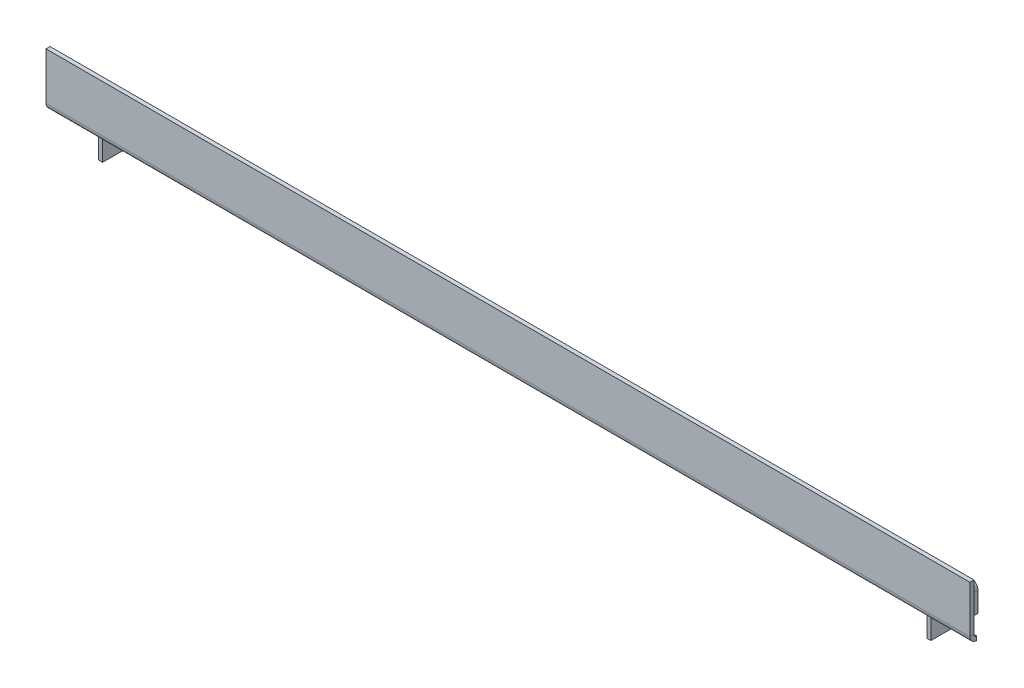
ISO-10303-21;
HEADER;
FILE_DESCRIPTION(('STEP AP214'),'2;1');
FILE_NAME('part.step','',(''),(''),'','','');
FILE_SCHEMA(('AUTOMOTIVE_DESIGN { 1 0 10303 214 1 1 1 1 }'));
ENDSEC;
DATA;
#1=APPLICATION_CONTEXT('core data for automotive mechanical design processes');
#2=APPLICATION_PROTOCOL_DEFINITION('international standard','automotive_design',2000,#1);
#3=PRODUCT_CONTEXT('',#1,'mechanical');
#4=PRODUCT('Part','Part','',(#3));
#5=PRODUCT_RELATED_PRODUCT_CATEGORY('part','',(#4));
#6=PRODUCT_DEFINITION_FORMATION('','',#4);
#7=PRODUCT_DEFINITION_CONTEXT('part definition',#1,'design');
#8=PRODUCT_DEFINITION('design','',#6,#7);
#9=PRODUCT_DEFINITION_SHAPE('','',#8);
#10=(LENGTH_UNIT() NAMED_UNIT(*) SI_UNIT(.MILLI.,.METRE.));
#11=(NAMED_UNIT(*) PLANE_ANGLE_UNIT() SI_UNIT($,.RADIAN.));
#12=(NAMED_UNIT(*) SI_UNIT($,.STERADIAN.) SOLID_ANGLE_UNIT());
#13=UNCERTAINTY_MEASURE_WITH_UNIT(LENGTH_MEASURE(1.E-05),#10,'distance_accuracy_value','');
#14=(GEOMETRIC_REPRESENTATION_CONTEXT(3) GLOBAL_UNCERTAINTY_ASSIGNED_CONTEXT((#13)) GLOBAL_UNIT_ASSIGNED_CONTEXT((#10,
#11,#12)) REPRESENTATION_CONTEXT('',''));
#15=CARTESIAN_POINT('',(0.,0.,0.));
#16=DIRECTION('',(0.,0.,1.));
#17=DIRECTION('',(1.,0.,0.));
#18=AXIS2_PLACEMENT_3D('',#15,#16,#17);
#19=CARTESIAN_POINT('',(343.,0.499999999999997,-0.999999999999997));
#20=DIRECTION('',(0.,0.,-1.));
#21=DIRECTION('',(0.,1.,0.));
#22=AXIS2_PLACEMENT_3D('',#19,#20,#21);
#23=PLANE('',#22);
#24=DIRECTION('',(1.,0.,0.));
#25=VECTOR('',#24,1.);
#26=CARTESIAN_POINT('',(343.,0.499999999999997,-0.999999999999997));
#27=LINE('',#26,#25);
#28=CARTESIAN_POINT('',(343.,0.499999999999997,-0.999999999999997));
#29=VERTEX_POINT('',#28);
#30=CARTESIAN_POINT('',(325.791287847478,0.499999999999997,-0.999999999999997));
#31=VERTEX_POINT('',#30);
#32=EDGE_CURVE('E366',#29,#31,#27,.F.);
#33=ORIENTED_EDGE('',*,*,#32,.T.);
#34=CARTESIAN_POINT('',(323.5,-0.500000000000007,-0.999999999999997));
#35=DIRECTION('',(0.,0.,1.));
#36=DIRECTION('',(1.,0.,0.));
#37=AXIS2_PLACEMENT_3D('',#34,#35,#36);
#38=CIRCLE('',#37,2.5);
#39=CARTESIAN_POINT('',(323.5,2.,-0.999999999999997));
#40=VERTEX_POINT('',#39);
#41=EDGE_CURVE('E13',#31,#40,#38,.T.);
#42=ORIENTED_EDGE('',*,*,#41,.T.);
#43=DIRECTION('',(1.,0.,0.));
#44=VECTOR('',#43,1.);
#45=CARTESIAN_POINT('',(343.,2.,-0.999999999999997));
#46=LINE('',#45,#44);
#47=CARTESIAN_POINT('',(343.,2.,-0.999999999999997));
#48=VERTEX_POINT('',#47);
#49=EDGE_CURVE('E379',#48,#40,#46,.F.);
#50=ORIENTED_EDGE('',*,*,#49,.F.);
#51=DIRECTION('',(0.,-1.,0.));
#52=VECTOR('',#51,1.);
#53=CARTESIAN_POINT('',(343.,2.,-0.999999999999997));
#54=LINE('',#53,#52);
#55=EDGE_CURVE('E372',#48,#29,#54,.T.);
#56=ORIENTED_EDGE('',*,*,#55,.T.);
#57=EDGE_LOOP('',(#33,#42,#50,#56));
#58=FACE_BOUND('',#57,.T.);
#59=ADVANCED_FACE('F78',(#58),#23,.T.);
#60=CARTESIAN_POINT('',(0.,2.,0.));
#61=DIRECTION('',(0.,-1.,0.));
#62=DIRECTION('',(0.,0.,-1.));
#63=AXIS2_PLACEMENT_3D('',#60,#61,#62);
#64=PLANE('',#63);
#65=DIRECTION('',(0.,0.,1.));
#66=VECTOR('',#65,1.);
#67=CARTESIAN_POINT('',(323.5,1.99999999999999,-0.999999999999997));
#68=LINE('',#67,#66);
#69=CARTESIAN_POINT('',(323.5,2.,-18.5));
#70=VERTEX_POINT('',#69);
#71=EDGE_CURVE('E218',#40,#70,#68,.F.);
#72=ORIENTED_EDGE('',*,*,#71,.T.);
#73=DIRECTION('',(-1.,0.,0.));
#74=VECTOR('',#73,1.);
#75=CARTESIAN_POINT('',(0.,2.,-18.5));
#76=LINE('',#75,#74);
#77=CARTESIAN_POINT('',(19.5,2.,-18.5));
#78=VERTEX_POINT('',#77);
#79=EDGE_CURVE('E87',#70,#78,#76,.T.);
#80=ORIENTED_EDGE('',*,*,#79,.T.);
#81=DIRECTION('',(0.,0.,-1.));
#82=VECTOR('',#81,1.);
#83=CARTESIAN_POINT('',(19.5,2.,-18.5));
#84=LINE('',#83,#82);
#85=CARTESIAN_POINT('',(19.5,2.,-1.));
#86=VERTEX_POINT('',#85);
#87=EDGE_CURVE('E308',#78,#86,#84,.F.);
#88=ORIENTED_EDGE('',*,*,#87,.T.);
#89=EDGE_CURVE('E382',#40,#86,#46,.F.);
#90=ORIENTED_EDGE('',*,*,#89,.F.);
#91=EDGE_LOOP('',(#72,#80,#88,#90));
#92=FACE_BOUND('',#91,.T.);
#93=ADVANCED_FACE('F430',(#92),#64,.F.);
#94=CARTESIAN_POINT('',(0.,0.5,0.));
#95=DIRECTION('',(0.,-1.,0.));
#96=DIRECTION('',(0.,0.,-1.));
#97=AXIS2_PLACEMENT_3D('',#94,#95,#96);
#98=PLANE('',#97);
#99=DIRECTION('',(1.,0.,0.));
#100=VECTOR('',#99,1.);
#101=CARTESIAN_POINT('',(0.,0.5,-18.5));
#102=LINE('',#101,#100);
#103=CARTESIAN_POINT('',(323.5,0.499999999999994,-18.5));
#104=VERTEX_POINT('',#103);
#105=CARTESIAN_POINT('',(19.5,0.500000000000001,-18.5));
#106=VERTEX_POINT('',#105);
#107=EDGE_CURVE('E82',#104,#106,#102,.F.);
#108=ORIENTED_EDGE('',*,*,#107,.F.);
#109=DIRECTION('',(0.,0.,1.));
#110=VECTOR('',#109,1.);
#111=CARTESIAN_POINT('',(323.5,0.499999999999994,-0.999999999999997));
#112=LINE('',#111,#110);
#113=CARTESIAN_POINT('',(323.5,0.499999999999994,-0.999999999999997));
#114=VERTEX_POINT('',#113);
#115=EDGE_CURVE('E269',#114,#104,#112,.F.);
#116=ORIENTED_EDGE('',*,*,#115,.F.);
#117=CARTESIAN_POINT('',(19.5,0.500000000000001,-1.));
#118=VERTEX_POINT('',#117);
#119=EDGE_CURVE('E369',#114,#118,#27,.F.);
#120=ORIENTED_EDGE('',*,*,#119,.T.);
#121=DIRECTION('',(0.,0.,-1.));
#122=VECTOR('',#121,1.);
#123=CARTESIAN_POINT('',(19.5,0.500000000000001,-18.5));
#124=LINE('',#123,#122);
#125=EDGE_CURVE('E322',#106,#118,#124,.F.);
#126=ORIENTED_EDGE('',*,*,#125,.F.);
#127=EDGE_LOOP('',(#108,#116,#120,#126));
#128=FACE_BOUND('',#127,.T.);
#129=ADVANCED_FACE('F398',(#128),#98,.T.);
#130=CARTESIAN_POINT('',(19.5,0.500000000000001,-1.));
#131=DIRECTION('',(0.,0.,-1.));
#132=DIRECTION('',(-1.,0.,0.));
#133=AXIS2_PLACEMENT_3D('',#130,#131,#132);
#134=PLANE('',#133);
#135=CARTESIAN_POINT('',(0.,2.,-0.999999999999997));
#136=VERTEX_POINT('',#135);
#137=EDGE_CURVE('E383',#86,#136,#46,.F.);
#138=ORIENTED_EDGE('',*,*,#137,.F.);
#139=CARTESIAN_POINT('',(19.5,-0.5,-1.));
#140=DIRECTION('',(0.,0.,-1.));
#141=DIRECTION('',(-1.,0.,0.));
#142=AXIS2_PLACEMENT_3D('',#139,#140,#141);
#143=CIRCLE('',#142,2.5);
#144=CARTESIAN_POINT('',(17.2087121525221,0.500000000000001,-1.));
#145=VERTEX_POINT('',#144);
#146=EDGE_CURVE('E313',#86,#145,#143,.F.);
#147=ORIENTED_EDGE('',*,*,#146,.T.);
#148=DIRECTION('',(-1.,0.,0.));
#149=VECTOR('',#148,1.);
#150=CARTESIAN_POINT('',(19.5,0.500000000000001,-1.));
#151=LINE('',#150,#149);
#152=CARTESIAN_POINT('',(0.,0.5,-0.999999999999997));
#153=VERTEX_POINT('',#152);
#154=EDGE_CURVE('E329',#145,#153,#151,.T.);
#155=ORIENTED_EDGE('',*,*,#154,.T.);
#156=DIRECTION('',(0.,-1.,0.));
#157=VECTOR('',#156,1.);
#158=CARTESIAN_POINT('',(0.,2.,-0.999999999999997));
#159=LINE('',#158,#157);
#160=EDGE_CURVE('E386',#136,#153,#159,.T.);
#161=ORIENTED_EDGE('',*,*,#160,.F.);
#162=EDGE_LOOP('',(#138,#147,#155,#161));
#163=FACE_BOUND('',#162,.T.);
#164=ADVANCED_FACE('F488',(#163),#134,.T.);
#165=CARTESIAN_POINT('',(0.,2.,-18.5));
#166=DIRECTION('',(0.,0.,1.));
#167=DIRECTION('',(-1.,0.,0.));
#168=AXIS2_PLACEMENT_3D('',#165,#166,#167);
#169=PLANE('',#168);
#170=DIRECTION('',(0.,1.,0.));
#171=VECTOR('',#170,1.);
#172=CARTESIAN_POINT('',(323.5,0.499999999999994,-18.5));
#173=LINE('',#172,#171);
#174=EDGE_CURVE('E265',#104,#70,#173,.T.);
#175=ORIENTED_EDGE('',*,*,#174,.F.);
#176=ORIENTED_EDGE('',*,*,#107,.T.);
#177=DIRECTION('',(0.,1.,0.));
#178=VECTOR('',#177,1.);
#179=CARTESIAN_POINT('',(19.5,0.500000000000001,-18.5));
#180=LINE('',#179,#178);
#181=EDGE_CURVE('E316',#106,#78,#180,.T.);
#182=ORIENTED_EDGE('',*,*,#181,.T.);
#183=ORIENTED_EDGE('',*,*,#79,.F.);
#184=EDGE_LOOP('',(#175,#176,#182,#183));
#185=FACE_BOUND('',#184,.T.);
#186=ADVANCED_FACE('F80',(#185),#169,.F.);
#187=CARTESIAN_POINT('',(0.,3.,-0.999999999999997));
#188=DIRECTION('',(-1.,0.,0.));
#189=DIRECTION('',(0.,0.,1.));
#190=AXIS2_PLACEMENT_3D('',#187,#188,#189);
#191=PLANE('',#190);
#192=DIRECTION('',(0.,0.,1.));
#193=VECTOR('',#192,1.);
#194=CARTESIAN_POINT('',(0.,3.,0.));
#195=LINE('',#194,#193);
#196=CARTESIAN_POINT('',(0.,2.99999999999999,0.));
#197=VERTEX_POINT('',#196);
#198=CARTESIAN_POINT('',(0.,2.99999999999999,1.5));
#199=VERTEX_POINT('',#198);
#200=EDGE_CURVE('E333',#197,#199,#195,.T.);
#201=ORIENTED_EDGE('',*,*,#200,.F.);
#202=CARTESIAN_POINT('',(0.,3.,-0.999999999999997));
#203=DIRECTION('',(1.,0.,0.));
#204=DIRECTION('',(0.,0.,-1.));
#205=AXIS2_PLACEMENT_3D('',#202,#203,#204);
#206=CIRCLE('',#205,1.);
#207=EDGE_CURVE('E376',#136,#197,#206,.F.);
#208=ORIENTED_EDGE('',*,*,#207,.F.);
#209=ORIENTED_EDGE('',*,*,#160,.T.);
#210=CARTESIAN_POINT('',(0.,3.,-0.999999999999997));
#211=DIRECTION('',(1.,0.,0.));
#212=DIRECTION('',(0.,0.,-1.));
#213=AXIS2_PLACEMENT_3D('',#210,#211,#212);
#214=CIRCLE('',#213,2.5);
#215=EDGE_CURVE('E368',#153,#199,#214,.F.);
#216=ORIENTED_EDGE('',*,*,#215,.T.);
#217=EDGE_LOOP('',(#201,#208,#209,#216));
#218=FACE_BOUND('',#217,.T.);
#219=ADVANCED_FACE('F517',(#218),#191,.T.);
#220=CARTESIAN_POINT('',(343.,3.,-0.999999999999997));
#221=DIRECTION('',(-1.,0.,0.));
#222=DIRECTION('',(0.,0.,1.));
#223=AXIS2_PLACEMENT_3D('',#220,#221,#222);
#224=PLANE('',#223);
#225=CARTESIAN_POINT('',(343.,3.,-0.999999999999997));
#226=DIRECTION('',(1.,0.,0.));
#227=DIRECTION('',(0.,0.,-1.));
#228=AXIS2_PLACEMENT_3D('',#225,#226,#227);
#229=CIRCLE('',#228,1.);
#230=CARTESIAN_POINT('',(343.,2.99999999999999,0.));
#231=VERTEX_POINT('',#230);
#232=EDGE_CURVE('E363',#231,#48,#229,.T.);
#233=ORIENTED_EDGE('',*,*,#232,.F.);
#234=DIRECTION('',(0.,0.,1.));
#235=VECTOR('',#234,1.);
#236=CARTESIAN_POINT('',(343.,3.,0.));
#237=LINE('',#236,#235);
#238=CARTESIAN_POINT('',(343.,3.,1.5));
#239=VERTEX_POINT('',#238);
#240=EDGE_CURVE('E336',#231,#239,#237,.T.);
#241=ORIENTED_EDGE('',*,*,#240,.T.);
#242=CARTESIAN_POINT('',(343.,3.,-0.999999999999997));
#243=DIRECTION('',(1.,0.,0.));
#244=DIRECTION('',(0.,0.,-1.));
#245=AXIS2_PLACEMENT_3D('',#242,#243,#244);
#246=CIRCLE('',#245,2.5);
#247=EDGE_CURVE('E373',#239,#29,#246,.T.);
#248=ORIENTED_EDGE('',*,*,#247,.T.);
#249=ORIENTED_EDGE('',*,*,#55,.F.);
#250=EDGE_LOOP('',(#233,#241,#248,#249));
#251=FACE_BOUND('',#250,.T.);
#252=ADVANCED_FACE('F514',(#251),#224,.F.);
#253=CARTESIAN_POINT('',(343.,3.,-0.999999999999997));
#254=DIRECTION('',(1.,0.,0.));
#255=DIRECTION('',(0.,0.,1.));
#256=AXIS2_PLACEMENT_3D('',#253,#254,#255);
#257=CYLINDRICAL_SURFACE('',#256,2.5);
#258=ORIENTED_EDGE('',*,*,#32,.F.);
#259=ORIENTED_EDGE('',*,*,#247,.F.);
#260=DIRECTION('',(1.,0.,0.));
#261=VECTOR('',#260,1.);
#262=CARTESIAN_POINT('',(0.,3.,1.5));
#263=LINE('',#262,#261);
#264=EDGE_CURVE('E339',#199,#239,#263,.T.);
#265=ORIENTED_EDGE('',*,*,#264,.F.);
#266=ORIENTED_EDGE('',*,*,#215,.F.);
#267=ORIENTED_EDGE('',*,*,#154,.F.);
#268=EDGE_CURVE('E330',#118,#145,#151,.T.);
#269=ORIENTED_EDGE('',*,*,#268,.F.);
#270=ORIENTED_EDGE('',*,*,#119,.F.);
#271=EDGE_CURVE('E96',#31,#114,#27,.F.);
#272=ORIENTED_EDGE('',*,*,#271,.F.);
#273=EDGE_LOOP('',(#258,#259,#265,#266,#267,#269,#270,#272));
#274=FACE_BOUND('',#273,.T.);
#275=ADVANCED_FACE('F511',(#274),#257,.T.);
#276=CARTESIAN_POINT('',(343.,3.,-0.999999999999997));
#277=DIRECTION('',(1.,0.,0.));
#278=DIRECTION('',(0.,0.,1.));
#279=AXIS2_PLACEMENT_3D('',#276,#277,#278);
#280=CYLINDRICAL_SURFACE('',#279,1.);
#281=ORIENTED_EDGE('',*,*,#49,.T.);
#282=ORIENTED_EDGE('',*,*,#89,.T.);
#283=ORIENTED_EDGE('',*,*,#137,.T.);
#284=ORIENTED_EDGE('',*,*,#207,.T.);
#285=DIRECTION('',(1.,0.,0.));
#286=VECTOR('',#285,1.);
#287=CARTESIAN_POINT('',(0.,3.,0.));
#288=LINE('',#287,#286);
#289=EDGE_CURVE('E334',#197,#231,#288,.T.);
#290=ORIENTED_EDGE('',*,*,#289,.T.);
#291=ORIENTED_EDGE('',*,*,#232,.T.);
#292=EDGE_LOOP('',(#281,#282,#283,#284,#290,#291));
#293=FACE_BOUND('',#292,.T.);
#294=ADVANCED_FACE('F434',(#293),#280,.F.);
#295=CARTESIAN_POINT('',(343.,1.99999999999999,1.5));
#296=DIRECTION('',(1.,0.,0.));
#297=DIRECTION('',(0.,0.,-1.));
#298=AXIS2_PLACEMENT_3D('',#295,#296,#297);
#299=PLANE('',#298);
#300=DIRECTION('',(0.,-1.,0.));
#301=VECTOR('',#300,1.);
#302=CARTESIAN_POINT('',(343.,1.99999999999999,1.5));
#303=LINE('',#302,#301);
#304=CARTESIAN_POINT('',(343.,20.5,1.50000000000006));
#305=VERTEX_POINT('',#304);
#306=EDGE_CURVE('E351',#305,#239,#303,.T.);
#307=ORIENTED_EDGE('',*,*,#306,.T.);
#308=ORIENTED_EDGE('',*,*,#240,.F.);
#309=DIRECTION('',(0.,-1.,0.));
#310=VECTOR('',#309,1.);
#311=CARTESIAN_POINT('',(343.,2.,0.));
#312=LINE('',#311,#310);
#313=CARTESIAN_POINT('',(343.,20.5,0.));
#314=VERTEX_POINT('',#313);
#315=EDGE_CURVE('E348',#314,#231,#312,.T.);
#316=ORIENTED_EDGE('',*,*,#315,.F.);
#317=DIRECTION('',(0.,0.,-1.));
#318=VECTOR('',#317,1.);
#319=CARTESIAN_POINT('',(343.,20.5,1.50000000000006));
#320=LINE('',#319,#318);
#321=EDGE_CURVE('E361',#305,#314,#320,.T.);
#322=ORIENTED_EDGE('',*,*,#321,.F.);
#323=EDGE_LOOP('',(#307,#308,#316,#322));
#324=FACE_BOUND('',#323,.T.);
#325=ADVANCED_FACE('F501',(#324),#299,.T.);
#326=CARTESIAN_POINT('',(0.,20.5,1.50000000000006));
#327=DIRECTION('',(-1.,0.,0.));
#328=DIRECTION('',(0.,0.,1.));
#329=AXIS2_PLACEMENT_3D('',#326,#327,#328);
#330=PLANE('',#329);
#331=DIRECTION('',(0.,1.,0.));
#332=VECTOR('',#331,1.);
#333=CARTESIAN_POINT('',(0.,20.5,0.));
#334=LINE('',#333,#332);
#335=CARTESIAN_POINT('',(0.,20.5,0.));
#336=VERTEX_POINT('',#335);
#337=EDGE_CURVE('E344',#197,#336,#334,.T.);
#338=ORIENTED_EDGE('',*,*,#337,.F.);
#339=ORIENTED_EDGE('',*,*,#200,.T.);
#340=DIRECTION('',(0.,1.,0.));
#341=VECTOR('',#340,1.);
#342=CARTESIAN_POINT('',(0.,20.5,1.50000000000006));
#343=LINE('',#342,#341);
#344=CARTESIAN_POINT('',(0.,20.5,1.50000000000006));
#345=VERTEX_POINT('',#344);
#346=EDGE_CURVE('E345',#199,#345,#343,.T.);
#347=ORIENTED_EDGE('',*,*,#346,.T.);
#348=DIRECTION('',(0.,0.,-1.));
#349=VECTOR('',#348,1.);
#350=CARTESIAN_POINT('',(0.,20.5,1.50000000000006));
#351=LINE('',#350,#349);
#352=EDGE_CURVE('E354',#345,#336,#351,.T.);
#353=ORIENTED_EDGE('',*,*,#352,.T.);
#354=EDGE_LOOP('',(#338,#339,#347,#353));
#355=FACE_BOUND('',#354,.T.);
#356=ADVANCED_FACE('F496',(#355),#330,.T.);
#357=CARTESIAN_POINT('',(0.,0.,1.49999999999999));
#358=DIRECTION('',(0.,0.,1.));
#359=DIRECTION('',(0.,-1.,0.));
#360=AXIS2_PLACEMENT_3D('',#357,#358,#359);
#361=PLANE('',#360);
#362=ORIENTED_EDGE('',*,*,#346,.F.);
#363=ORIENTED_EDGE('',*,*,#264,.T.);
#364=ORIENTED_EDGE('',*,*,#306,.F.);
#365=DIRECTION('',(1.,0.,0.));
#366=VECTOR('',#365,1.);
#367=CARTESIAN_POINT('',(343.,20.5,1.50000000000006));
#368=LINE('',#367,#366);
#369=EDGE_CURVE('E347',#345,#305,#368,.T.);
#370=ORIENTED_EDGE('',*,*,#369,.F.);
#371=EDGE_LOOP('',(#362,#363,#364,#370));
#372=FACE_BOUND('',#371,.T.);
#373=ADVANCED_FACE('F492',(#372),#361,.T.);
#374=CARTESIAN_POINT('',(0.,0.,0.));
#375=DIRECTION('',(0.,0.,1.));
#376=DIRECTION('',(0.,-1.,0.));
#377=AXIS2_PLACEMENT_3D('',#374,#375,#376);
#378=PLANE('',#377);
#379=ORIENTED_EDGE('',*,*,#289,.F.);
#380=ORIENTED_EDGE('',*,*,#337,.T.);
#381=DIRECTION('',(1.,0.,0.));
#382=VECTOR('',#381,1.);
#383=CARTESIAN_POINT('',(343.,20.5,0.));
#384=LINE('',#383,#382);
#385=EDGE_CURVE('E356',#336,#314,#384,.T.);
#386=ORIENTED_EDGE('',*,*,#385,.T.);
#387=ORIENTED_EDGE('',*,*,#315,.T.);
#388=EDGE_LOOP('',(#379,#380,#386,#387));
#389=FACE_BOUND('',#388,.T.);
#390=ADVANCED_FACE('F495',(#389),#378,.F.);
#391=CARTESIAN_POINT('',(343.,20.5,1.50000000000006));
#392=DIRECTION('',(0.,1.,0.));
#393=DIRECTION('',(0.,0.,1.));
#394=AXIS2_PLACEMENT_3D('',#391,#392,#393);
#395=PLANE('',#394);
#396=ORIENTED_EDGE('',*,*,#385,.F.);
#397=ORIENTED_EDGE('',*,*,#352,.F.);
#398=ORIENTED_EDGE('',*,*,#369,.T.);
#399=ORIENTED_EDGE('',*,*,#321,.T.);
#400=EDGE_LOOP('',(#396,#397,#398,#399));
#401=FACE_BOUND('',#400,.T.);
#402=ADVANCED_FACE('F484',(#401),#395,.T.);
#403=CARTESIAN_POINT('',(19.5,-0.5,-1.));
#404=DIRECTION('',(0.,0.,1.));
#405=DIRECTION('',(1.,0.,0.));
#406=AXIS2_PLACEMENT_3D('',#403,#404,#405);
#407=PLANE('',#406);
#408=CARTESIAN_POINT('',(19.5,-0.5,-1.));
#409=DIRECTION('',(0.,0.,-1.));
#410=DIRECTION('',(-1.,0.,0.));
#411=AXIS2_PLACEMENT_3D('',#408,#409,#410);
#412=CIRCLE('',#411,1.);
#413=CARTESIAN_POINT('',(18.5,-0.499999999999997,-1.));
#414=VERTEX_POINT('',#413);
#415=EDGE_CURVE('E319',#118,#414,#412,.F.);
#416=ORIENTED_EDGE('',*,*,#415,.F.);
#417=ORIENTED_EDGE('',*,*,#268,.T.);
#418=CARTESIAN_POINT('',(17.,-0.499999999999991,-1.));
#419=VERTEX_POINT('',#418);
#420=EDGE_CURVE('E311',#145,#419,#143,.F.);
#421=ORIENTED_EDGE('',*,*,#420,.T.);
#422=DIRECTION('',(-1.,0.,0.));
#423=VECTOR('',#422,1.);
#424=CARTESIAN_POINT('',(17.,-0.499999999999992,-0.999999999999997));
#425=LINE('',#424,#423);
#426=EDGE_CURVE('E275',#414,#419,#425,.T.);
#427=ORIENTED_EDGE('',*,*,#426,.F.);
#428=EDGE_LOOP('',(#416,#417,#421,#427));
#429=FACE_BOUND('',#428,.T.);
#430=ADVANCED_FACE('F481',(#429),#407,.T.);
#431=CARTESIAN_POINT('',(19.5,-0.5,-18.5));
#432=DIRECTION('',(0.,0.,1.));
#433=DIRECTION('',(1.,0.,0.));
#434=AXIS2_PLACEMENT_3D('',#431,#432,#433);
#435=PLANE('',#434);
#436=CARTESIAN_POINT('',(19.5,-0.5,-18.5));
#437=DIRECTION('',(0.,0.,-1.));
#438=DIRECTION('',(-1.,0.,0.));
#439=AXIS2_PLACEMENT_3D('',#436,#437,#438);
#440=CIRCLE('',#439,1.);
#441=CARTESIAN_POINT('',(18.5,-0.499999999999997,-18.5));
#442=VERTEX_POINT('',#441);
#443=EDGE_CURVE('E278',#442,#106,#440,.T.);
#444=ORIENTED_EDGE('',*,*,#443,.F.);
#445=DIRECTION('',(-1.,0.,0.));
#446=VECTOR('',#445,1.);
#447=CARTESIAN_POINT('',(18.5,-0.499999999999997,-18.5));
#448=LINE('',#447,#446);
#449=CARTESIAN_POINT('',(17.,-0.499999999999991,-18.5));
#450=VERTEX_POINT('',#449);
#451=EDGE_CURVE('E301',#442,#450,#448,.T.);
#452=ORIENTED_EDGE('',*,*,#451,.T.);
#453=CARTESIAN_POINT('',(19.5,-0.5,-18.5));
#454=DIRECTION('',(0.,0.,-1.));
#455=DIRECTION('',(-1.,0.,0.));
#456=AXIS2_PLACEMENT_3D('',#453,#454,#455);
#457=CIRCLE('',#456,2.5);
#458=EDGE_CURVE('E312',#450,#78,#457,.T.);
#459=ORIENTED_EDGE('',*,*,#458,.T.);
#460=ORIENTED_EDGE('',*,*,#181,.F.);
#461=EDGE_LOOP('',(#444,#452,#459,#460));
#462=FACE_BOUND('',#461,.T.);
#463=ADVANCED_FACE('F404',(#462),#435,.F.);
#464=CARTESIAN_POINT('',(19.5,-0.5,-18.5));
#465=DIRECTION('',(0.,0.,-1.));
#466=DIRECTION('',(-1.,0.,0.));
#467=AXIS2_PLACEMENT_3D('',#464,#465,#466);
#468=CYLINDRICAL_SURFACE('',#467,2.5);
#469=ORIENTED_EDGE('',*,*,#87,.F.);
#470=ORIENTED_EDGE('',*,*,#458,.F.);
#471=DIRECTION('',(0.,0.,-1.));
#472=VECTOR('',#471,1.);
#473=CARTESIAN_POINT('',(17.,-0.499999999999991,0.));
#474=LINE('',#473,#472);
#475=EDGE_CURVE('E298',#419,#450,#474,.T.);
#476=ORIENTED_EDGE('',*,*,#475,.F.);
#477=ORIENTED_EDGE('',*,*,#420,.F.);
#478=ORIENTED_EDGE('',*,*,#146,.F.);
#479=EDGE_LOOP('',(#469,#470,#476,#477,#478));
#480=FACE_BOUND('',#479,.T.);
#481=ADVANCED_FACE('F428',(#480),#468,.T.);
#482=CARTESIAN_POINT('',(19.5,-0.5,-18.5));
#483=DIRECTION('',(0.,0.,-1.));
#484=DIRECTION('',(-1.,0.,0.));
#485=AXIS2_PLACEMENT_3D('',#482,#483,#484);
#486=CYLINDRICAL_SURFACE('',#485,1.);
#487=ORIENTED_EDGE('',*,*,#125,.T.);
#488=ORIENTED_EDGE('',*,*,#415,.T.);
#489=DIRECTION('',(0.,0.,1.));
#490=VECTOR('',#489,1.);
#491=CARTESIAN_POINT('',(18.5,-0.499999999999997,-0.999999999999997));
#492=LINE('',#491,#490);
#493=EDGE_CURVE('E304',#414,#442,#492,.F.);
#494=ORIENTED_EDGE('',*,*,#493,.T.);
#495=ORIENTED_EDGE('',*,*,#443,.T.);
#496=EDGE_LOOP('',(#487,#488,#494,#495));
#497=FACE_BOUND('',#496,.T.);
#498=ADVANCED_FACE('F405',(#497),#486,.F.);
#499=CARTESIAN_POINT('',(17.,0.500000000000005,-18.5));
#500=DIRECTION('',(0.,0.,-1.));
#501=DIRECTION('',(-1.,0.,0.));
#502=AXIS2_PLACEMENT_3D('',#499,#500,#501);
#503=PLANE('',#502);
#504=DIRECTION('',(0.,1.,0.));
#505=VECTOR('',#504,1.);
#506=CARTESIAN_POINT('',(17.,0.500000000000005,-18.5));
#507=LINE('',#506,#505);
#508=CARTESIAN_POINT('',(17.,-8.,-18.5));
#509=VERTEX_POINT('',#508);
#510=EDGE_CURVE('E282',#509,#450,#507,.T.);
#511=ORIENTED_EDGE('',*,*,#510,.T.);
#512=ORIENTED_EDGE('',*,*,#451,.F.);
#513=DIRECTION('',(0.,-1.,0.));
#514=VECTOR('',#513,1.);
#515=CARTESIAN_POINT('',(18.5,0.,-18.5));
#516=LINE('',#515,#514);
#517=CARTESIAN_POINT('',(18.5,-8.00000000000001,-18.5));
#518=VERTEX_POINT('',#517);
#519=EDGE_CURVE('E290',#518,#442,#516,.F.);
#520=ORIENTED_EDGE('',*,*,#519,.F.);
#521=DIRECTION('',(1.,0.,0.));
#522=VECTOR('',#521,1.);
#523=CARTESIAN_POINT('',(17.,-8.,-18.5));
#524=LINE('',#523,#522);
#525=EDGE_CURVE('E276',#509,#518,#524,.T.);
#526=ORIENTED_EDGE('',*,*,#525,.F.);
#527=EDGE_LOOP('',(#511,#512,#520,#526));
#528=FACE_BOUND('',#527,.T.);
#529=ADVANCED_FACE('F421',(#528),#503,.T.);
#530=CARTESIAN_POINT('',(17.,-8.,-0.999999999999998));
#531=DIRECTION('',(0.,0.,1.));
#532=DIRECTION('',(0.,-1.,0.));
#533=AXIS2_PLACEMENT_3D('',#530,#531,#532);
#534=PLANE('',#533);
#535=DIRECTION('',(0.,1.,0.));
#536=VECTOR('',#535,1.);
#537=CARTESIAN_POINT('',(18.5,0.,-0.999999999999997));
#538=LINE('',#537,#536);
#539=CARTESIAN_POINT('',(18.5,-8.00000000000001,-0.999999999999998));
#540=VERTEX_POINT('',#539);
#541=EDGE_CURVE('E296',#414,#540,#538,.F.);
#542=ORIENTED_EDGE('',*,*,#541,.F.);
#543=ORIENTED_EDGE('',*,*,#426,.T.);
#544=DIRECTION('',(0.,-1.,0.));
#545=VECTOR('',#544,1.);
#546=CARTESIAN_POINT('',(17.,-8.,-0.999999999999998));
#547=LINE('',#546,#545);
#548=CARTESIAN_POINT('',(17.,-8.,-0.999999999999998));
#549=VERTEX_POINT('',#548);
#550=EDGE_CURVE('E288',#419,#549,#547,.T.);
#551=ORIENTED_EDGE('',*,*,#550,.T.);
#552=DIRECTION('',(1.,0.,0.));
#553=VECTOR('',#552,1.);
#554=CARTESIAN_POINT('',(17.,-8.,-0.999999999999998));
#555=LINE('',#554,#553);
#556=EDGE_CURVE('E279',#549,#540,#555,.T.);
#557=ORIENTED_EDGE('',*,*,#556,.T.);
#558=EDGE_LOOP('',(#542,#543,#551,#557));
#559=FACE_BOUND('',#558,.T.);
#560=ADVANCED_FACE('F413',(#559),#534,.T.);
#561=CARTESIAN_POINT('',(17.,0.,0.));
#562=DIRECTION('',(-1.,0.,0.));
#563=DIRECTION('',(0.,-1.,0.));
#564=AXIS2_PLACEMENT_3D('',#561,#562,#563);
#565=PLANE('',#564);
#566=ORIENTED_EDGE('',*,*,#550,.F.);
#567=ORIENTED_EDGE('',*,*,#475,.T.);
#568=ORIENTED_EDGE('',*,*,#510,.F.);
#569=DIRECTION('',(0.,0.,-1.));
#570=VECTOR('',#569,1.);
#571=CARTESIAN_POINT('',(17.,-8.,-18.5));
#572=LINE('',#571,#570);
#573=EDGE_CURVE('E285',#549,#509,#572,.T.);
#574=ORIENTED_EDGE('',*,*,#573,.F.);
#575=EDGE_LOOP('',(#566,#567,#568,#574));
#576=FACE_BOUND('',#575,.T.);
#577=ADVANCED_FACE('F425',(#576),#565,.T.);
#578=CARTESIAN_POINT('',(18.5,0.,0.));
#579=DIRECTION('',(-1.,0.,0.));
#580=DIRECTION('',(0.,-1.,0.));
#581=AXIS2_PLACEMENT_3D('',#578,#579,#580);
#582=PLANE('',#581);
#583=ORIENTED_EDGE('',*,*,#493,.F.);
#584=ORIENTED_EDGE('',*,*,#541,.T.);
#585=DIRECTION('',(0.,0.,1.));
#586=VECTOR('',#585,1.);
#587=CARTESIAN_POINT('',(18.5,-8.00000000000001,0.));
#588=LINE('',#587,#586);
#589=EDGE_CURVE('E293',#540,#518,#588,.F.);
#590=ORIENTED_EDGE('',*,*,#589,.T.);
#591=ORIENTED_EDGE('',*,*,#519,.T.);
#592=EDGE_LOOP('',(#583,#584,#590,#591));
#593=FACE_BOUND('',#592,.T.);
#594=ADVANCED_FACE('F409',(#593),#582,.F.);
#595=CARTESIAN_POINT('',(17.,-8.,-18.5));
#596=DIRECTION('',(0.,-1.,0.));
#597=DIRECTION('',(1.,0.,0.));
#598=AXIS2_PLACEMENT_3D('',#595,#596,#597);
#599=PLANE('',#598);
#600=ORIENTED_EDGE('',*,*,#589,.F.);
#601=ORIENTED_EDGE('',*,*,#556,.F.);
#602=ORIENTED_EDGE('',*,*,#573,.T.);
#603=ORIENTED_EDGE('',*,*,#525,.T.);
#604=EDGE_LOOP('',(#600,#601,#602,#603));
#605=FACE_BOUND('',#604,.T.);
#606=ADVANCED_FACE('F419',(#605),#599,.T.);
#607=CARTESIAN_POINT('',(323.5,-0.500000000000007,-18.5));
#608=DIRECTION('',(0.,0.,-1.));
#609=DIRECTION('',(-1.,0.,0.));
#610=AXIS2_PLACEMENT_3D('',#607,#608,#609);
#611=PLANE('',#610);
#612=DIRECTION('',(1.,0.,0.));
#613=VECTOR('',#612,1.);
#614=CARTESIAN_POINT('',(326.,-0.499999999999991,-18.5));
#615=LINE('',#614,#613);
#616=CARTESIAN_POINT('',(324.5,-0.5,-18.5));
#617=VERTEX_POINT('',#616);
#618=CARTESIAN_POINT('',(326.,-0.499999999999991,-18.5));
#619=VERTEX_POINT('',#618);
#620=EDGE_CURVE('E260',#617,#619,#615,.T.);
#621=ORIENTED_EDGE('',*,*,#620,.F.);
#622=CARTESIAN_POINT('',(323.5,-0.500000000000007,-18.5));
#623=DIRECTION('',(0.,0.,1.));
#624=DIRECTION('',(1.,0.,0.));
#625=AXIS2_PLACEMENT_3D('',#622,#623,#624);
#626=CIRCLE('',#625,1.);
#627=EDGE_CURVE('E219',#104,#617,#626,.F.);
#628=ORIENTED_EDGE('',*,*,#627,.F.);
#629=ORIENTED_EDGE('',*,*,#174,.T.);
#630=CARTESIAN_POINT('',(323.5,-0.500000000000007,-18.5));
#631=DIRECTION('',(0.,0.,1.));
#632=DIRECTION('',(1.,0.,0.));
#633=AXIS2_PLACEMENT_3D('',#630,#631,#632);
#634=CIRCLE('',#633,2.5);
#635=EDGE_CURVE('E264',#70,#619,#634,.F.);
#636=ORIENTED_EDGE('',*,*,#635,.T.);
#637=EDGE_LOOP('',(#621,#628,#629,#636));
#638=FACE_BOUND('',#637,.T.);
#639=ADVANCED_FACE('F438',(#638),#611,.T.);
#640=CARTESIAN_POINT('',(323.5,-0.500000000000007,-0.999999999999997));
#641=DIRECTION('',(0.,0.,-1.));
#642=DIRECTION('',(-1.,0.,0.));
#643=AXIS2_PLACEMENT_3D('',#640,#641,#642);
#644=PLANE('',#643);
#645=CARTESIAN_POINT('',(326.,-0.499999999999991,-0.999999999999997));
#646=VERTEX_POINT('',#645);
#647=EDGE_CURVE('E89',#646,#31,#38,.T.);
#648=ORIENTED_EDGE('',*,*,#647,.T.);
#649=ORIENTED_EDGE('',*,*,#271,.T.);
#650=CARTESIAN_POINT('',(323.5,-0.500000000000007,-0.999999999999997));
#651=DIRECTION('',(0.,0.,1.));
#652=DIRECTION('',(1.,0.,0.));
#653=AXIS2_PLACEMENT_3D('',#650,#651,#652);
#654=CIRCLE('',#653,1.);
#655=CARTESIAN_POINT('',(324.5,-0.5,-0.999999999999997));
#656=VERTEX_POINT('',#655);
#657=EDGE_CURVE('E225',#656,#114,#654,.T.);
#658=ORIENTED_EDGE('',*,*,#657,.F.);
#659=DIRECTION('',(1.,0.,0.));
#660=VECTOR('',#659,1.);
#661=CARTESIAN_POINT('',(324.5,-0.5,-0.999999999999997));
#662=LINE('',#661,#660);
#663=EDGE_CURVE('E222',#656,#646,#662,.T.);
#664=ORIENTED_EDGE('',*,*,#663,.T.);
#665=EDGE_LOOP('',(#648,#649,#658,#664));
#666=FACE_BOUND('',#665,.T.);
#667=ADVANCED_FACE('F223',(#666),#644,.F.);
#668=CARTESIAN_POINT('',(323.5,-0.500000000000007,-0.999999999999997));
#669=DIRECTION('',(0.,0.,1.));
#670=DIRECTION('',(1.,0.,0.));
#671=AXIS2_PLACEMENT_3D('',#668,#669,#670);
#672=CYLINDRICAL_SURFACE('',#671,2.5);
#673=ORIENTED_EDGE('',*,*,#71,.F.);
#674=ORIENTED_EDGE('',*,*,#41,.F.);
#675=ORIENTED_EDGE('',*,*,#647,.F.);
#676=DIRECTION('',(0.,0.,1.));
#677=VECTOR('',#676,1.);
#678=CARTESIAN_POINT('',(326.,-0.499999999999991,0.));
#679=LINE('',#678,#677);
#680=EDGE_CURVE('E215',#619,#646,#679,.T.);
#681=ORIENTED_EDGE('',*,*,#680,.F.);
#682=ORIENTED_EDGE('',*,*,#635,.F.);
#683=EDGE_LOOP('',(#673,#674,#675,#681,#682));
#684=FACE_BOUND('',#683,.T.);
#685=ADVANCED_FACE('F212',(#684),#672,.T.);
#686=CARTESIAN_POINT('',(323.5,-0.500000000000007,-0.999999999999997));
#687=DIRECTION('',(0.,0.,1.));
#688=DIRECTION('',(1.,0.,0.));
#689=AXIS2_PLACEMENT_3D('',#686,#687,#688);
#690=CYLINDRICAL_SURFACE('',#689,1.);
#691=ORIENTED_EDGE('',*,*,#115,.T.);
#692=ORIENTED_EDGE('',*,*,#627,.T.);
#693=DIRECTION('',(0.,0.,-1.));
#694=VECTOR('',#693,1.);
#695=CARTESIAN_POINT('',(324.5,-0.5,-18.5));
#696=LINE('',#695,#694);
#697=EDGE_CURVE('E230',#617,#656,#696,.F.);
#698=ORIENTED_EDGE('',*,*,#697,.T.);
#699=ORIENTED_EDGE('',*,*,#657,.T.);
#700=EDGE_LOOP('',(#691,#692,#698,#699));
#701=FACE_BOUND('',#700,.T.);
#702=ADVANCED_FACE('F449',(#701),#690,.F.);
#703=CARTESIAN_POINT('',(326.,0.500000000000002,-0.999999999999997));
#704=DIRECTION('',(0.,0.,1.));
#705=DIRECTION('',(0.,-1.,0.));
#706=AXIS2_PLACEMENT_3D('',#703,#704,#705);
#707=PLANE('',#706);
#708=DIRECTION('',(0.,1.,0.));
#709=VECTOR('',#708,1.);
#710=CARTESIAN_POINT('',(326.,0.500000000000002,-0.999999999999997));
#711=LINE('',#710,#709);
#712=CARTESIAN_POINT('',(326.,-8.,-0.999999999999999));
#713=VERTEX_POINT('',#712);
#714=EDGE_CURVE('E237',#713,#646,#711,.T.);
#715=ORIENTED_EDGE('',*,*,#714,.T.);
#716=ORIENTED_EDGE('',*,*,#663,.F.);
#717=DIRECTION('',(0.,-1.,0.));
#718=VECTOR('',#717,1.);
#719=CARTESIAN_POINT('',(324.5,2.24034434794534E-12,-0.999999999999997));
#720=LINE('',#719,#718);
#721=CARTESIAN_POINT('',(324.5,-8.00000000000001,-0.999999999999999));
#722=VERTEX_POINT('',#721);
#723=EDGE_CURVE('E253',#722,#656,#720,.F.);
#724=ORIENTED_EDGE('',*,*,#723,.F.);
#725=DIRECTION('',(-1.,0.,0.));
#726=VECTOR('',#725,1.);
#727=CARTESIAN_POINT('',(326.,-8.,-0.999999999999999));
#728=LINE('',#727,#726);
#729=EDGE_CURVE('E242',#713,#722,#728,.T.);
#730=ORIENTED_EDGE('',*,*,#729,.F.);
#731=EDGE_LOOP('',(#715,#716,#724,#730));
#732=FACE_BOUND('',#731,.T.);
#733=ADVANCED_FACE('F241',(#732),#707,.T.);
#734=CARTESIAN_POINT('',(326.,-8.,-18.5));
#735=DIRECTION('',(0.,0.,-1.));
#736=DIRECTION('',(-1.,0.,0.));
#737=AXIS2_PLACEMENT_3D('',#734,#735,#736);
#738=PLANE('',#737);
#739=DIRECTION('',(0.,1.,0.));
#740=VECTOR('',#739,1.);
#741=CARTESIAN_POINT('',(324.5,2.24003822027311E-12,-18.5));
#742=LINE('',#741,#740);
#743=CARTESIAN_POINT('',(324.5,-8.00000000000001,-18.5));
#744=VERTEX_POINT('',#743);
#745=EDGE_CURVE('E239',#617,#744,#742,.F.);
#746=ORIENTED_EDGE('',*,*,#745,.F.);
#747=ORIENTED_EDGE('',*,*,#620,.T.);
#748=DIRECTION('',(0.,-1.,0.));
#749=VECTOR('',#748,1.);
#750=CARTESIAN_POINT('',(326.,-8.,-18.5));
#751=LINE('',#750,#749);
#752=CARTESIAN_POINT('',(326.,-8.,-18.5));
#753=VERTEX_POINT('',#752);
#754=EDGE_CURVE('E238',#619,#753,#751,.T.);
#755=ORIENTED_EDGE('',*,*,#754,.T.);
#756=DIRECTION('',(-1.,0.,0.));
#757=VECTOR('',#756,1.);
#758=CARTESIAN_POINT('',(326.,-8.,-18.5));
#759=LINE('',#758,#757);
#760=EDGE_CURVE('E244',#753,#744,#759,.T.);
#761=ORIENTED_EDGE('',*,*,#760,.T.);
#762=EDGE_LOOP('',(#746,#747,#755,#761));
#763=FACE_BOUND('',#762,.T.);
#764=ADVANCED_FACE('F442',(#763),#738,.T.);
#765=CARTESIAN_POINT('',(326.,2.24527544531477E-12,0.));
#766=DIRECTION('',(1.,0.,0.));
#767=DIRECTION('',(0.,1.,0.));
#768=AXIS2_PLACEMENT_3D('',#765,#766,#767);
#769=PLANE('',#768);
#770=ORIENTED_EDGE('',*,*,#754,.F.);
#771=ORIENTED_EDGE('',*,*,#680,.T.);
#772=ORIENTED_EDGE('',*,*,#714,.F.);
#773=DIRECTION('',(0.,0.,1.));
#774=VECTOR('',#773,1.);
#775=CARTESIAN_POINT('',(326.,-8.,-0.999999999999999));
#776=LINE('',#775,#774);
#777=EDGE_CURVE('E245',#753,#713,#776,.T.);
#778=ORIENTED_EDGE('',*,*,#777,.F.);
#779=EDGE_LOOP('',(#770,#771,#772,#778));
#780=FACE_BOUND('',#779,.T.);
#781=ADVANCED_FACE('F235',(#780),#769,.T.);
#782=CARTESIAN_POINT('',(324.5,2.24003822027311E-12,0.));
#783=DIRECTION('',(1.,0.,0.));
#784=DIRECTION('',(0.,1.,0.));
#785=AXIS2_PLACEMENT_3D('',#782,#783,#784);
#786=PLANE('',#785);
#787=ORIENTED_EDGE('',*,*,#697,.F.);
#788=ORIENTED_EDGE('',*,*,#745,.T.);
#789=DIRECTION('',(0.,0.,-1.));
#790=VECTOR('',#789,1.);
#791=CARTESIAN_POINT('',(324.5,-8.00000000000001,0.));
#792=LINE('',#791,#790);
#793=EDGE_CURVE('E255',#744,#722,#792,.F.);
#794=ORIENTED_EDGE('',*,*,#793,.T.);
#795=ORIENTED_EDGE('',*,*,#723,.T.);
#796=EDGE_LOOP('',(#787,#788,#794,#795));
#797=FACE_BOUND('',#796,.T.);
#798=ADVANCED_FACE('F447',(#797),#786,.F.);
#799=CARTESIAN_POINT('',(326.,-8.,-0.999999999999999));
#800=DIRECTION('',(0.,-1.,0.));
#801=DIRECTION('',(1.,0.,0.));
#802=AXIS2_PLACEMENT_3D('',#799,#800,#801);
#803=PLANE('',#802);
#804=ORIENTED_EDGE('',*,*,#793,.F.);
#805=ORIENTED_EDGE('',*,*,#760,.F.);
#806=ORIENTED_EDGE('',*,*,#777,.T.);
#807=ORIENTED_EDGE('',*,*,#729,.T.);
#808=EDGE_LOOP('',(#804,#805,#806,#807));
#809=FACE_BOUND('',#808,.T.);
#810=ADVANCED_FACE('F663',(#809),#803,.T.);
#811=CLOSED_SHELL('',(#59,#93,#129,#164,#186,#219,#252,#275,#294,#325,#356,#373,#390,#402,#430,
#463,#481,#498,#529,#560,#577,#594,#606,#639,#667,#685,#702,#733,#764,#781,#798,#810));
#812=MANIFOLD_SOLID_BREP('B2',#811);
#813=ADVANCED_BREP_SHAPE_REPRESENTATION('',(#18,#812),#14);
#814=SHAPE_DEFINITION_REPRESENTATION(#9,#813);
ENDSEC;
END-ISO-10303-21;
